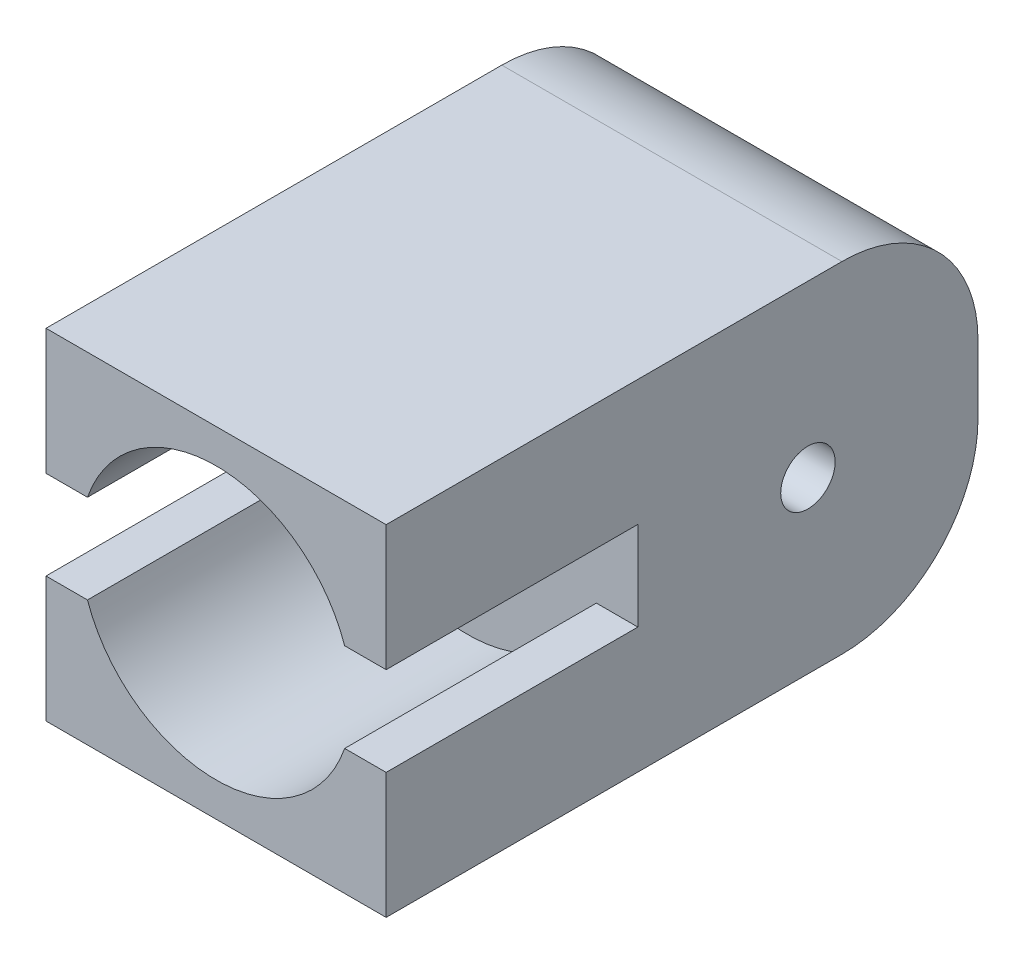
ISO-10303-21;
HEADER;
FILE_DESCRIPTION(('STEP AP214'),'2;1');
FILE_NAME('part.step','',(''),(''),'','','');
FILE_SCHEMA(('AUTOMOTIVE_DESIGN { 1 0 10303 214 1 1 1 1 }'));
ENDSEC;
DATA;
#1=APPLICATION_CONTEXT('core data for automotive mechanical design processes');
#2=APPLICATION_PROTOCOL_DEFINITION('international standard','automotive_design',2000,#1);
#3=PRODUCT_CONTEXT('',#1,'mechanical');
#4=PRODUCT('Part','Part','',(#3));
#5=PRODUCT_RELATED_PRODUCT_CATEGORY('part','',(#4));
#6=PRODUCT_DEFINITION_FORMATION('','',#4);
#7=PRODUCT_DEFINITION_CONTEXT('part definition',#1,'design');
#8=PRODUCT_DEFINITION('design','',#6,#7);
#9=PRODUCT_DEFINITION_SHAPE('','',#8);
#10=(LENGTH_UNIT() NAMED_UNIT(*) SI_UNIT(.MILLI.,.METRE.));
#11=(NAMED_UNIT(*) PLANE_ANGLE_UNIT() SI_UNIT($,.RADIAN.));
#12=(NAMED_UNIT(*) SI_UNIT($,.STERADIAN.) SOLID_ANGLE_UNIT());
#13=UNCERTAINTY_MEASURE_WITH_UNIT(LENGTH_MEASURE(1.E-05),#10,'distance_accuracy_value','');
#14=(GEOMETRIC_REPRESENTATION_CONTEXT(3) GLOBAL_UNCERTAINTY_ASSIGNED_CONTEXT((#13)) GLOBAL_UNIT_ASSIGNED_CONTEXT((#10,
#11,#12)) REPRESENTATION_CONTEXT('',''));
#15=CARTESIAN_POINT('',(0.,0.,0.));
#16=DIRECTION('',(0.,0.,1.));
#17=DIRECTION('',(1.,0.,0.));
#18=AXIS2_PLACEMENT_3D('',#15,#16,#17);
#19=CARTESIAN_POINT('',(0.,0.,37.));
#20=DIRECTION('',(0.,0.,-1.));
#21=DIRECTION('',(-1.,0.,0.));
#22=AXIS2_PLACEMENT_3D('',#19,#20,#21);
#23=CYLINDRICAL_SURFACE('',#22,20.);
#24=CARTESIAN_POINT('',(0.,0.,0.));
#25=DIRECTION('',(0.,0.,1.));
#26=DIRECTION('',(1.,0.,0.));
#27=AXIS2_PLACEMENT_3D('',#24,#25,#26);
#28=CIRCLE('',#27,20.);
#29=CARTESIAN_POINT('',(18.9022133151,6.53500817064945,0.));
#30=VERTEX_POINT('',#29);
#31=CARTESIAN_POINT('',(-18.9022133151,6.53500817064945,0.));
#32=VERTEX_POINT('',#31);
#33=EDGE_CURVE('E219',#30,#32,#28,.T.);
#34=ORIENTED_EDGE('',*,*,#33,.F.);
#35=DIRECTION('',(0.,0.,-1.));
#36=VECTOR('',#35,1.);
#37=CARTESIAN_POINT('',(18.9022133151,6.53500817064945,37.));
#38=LINE('',#37,#36);
#39=CARTESIAN_POINT('',(18.9022133151,6.53500817064945,37.));
#40=VERTEX_POINT('',#39);
#41=EDGE_CURVE('E267',#40,#30,#38,.T.);
#42=ORIENTED_EDGE('',*,*,#41,.F.);
#43=CARTESIAN_POINT('',(0.,0.,37.));
#44=DIRECTION('',(0.,0.,1.));
#45=DIRECTION('',(1.,0.,0.));
#46=AXIS2_PLACEMENT_3D('',#43,#44,#45);
#47=CIRCLE('',#46,20.);
#48=CARTESIAN_POINT('',(-18.9022133151,6.53500817064945,37.));
#49=VERTEX_POINT('',#48);
#50=EDGE_CURVE('E222',#40,#49,#47,.T.);
#51=ORIENTED_EDGE('',*,*,#50,.T.);
#52=DIRECTION('',(0.,0.,-1.));
#53=VECTOR('',#52,1.);
#54=CARTESIAN_POINT('',(-18.9022133151,6.53500817064945,37.));
#55=LINE('',#54,#53);
#56=EDGE_CURVE('E249',#49,#32,#55,.T.);
#57=ORIENTED_EDGE('',*,*,#56,.T.);
#58=EDGE_LOOP('',(#34,#42,#51,#57));
#59=FACE_BOUND('',#58,.T.);
#60=ADVANCED_FACE('F40',(#59),#23,.F.);
#61=CARTESIAN_POINT('',(0.,6.53500817064945,37.));
#62=DIRECTION('',(0.,1.,0.));
#63=DIRECTION('',(-1.,0.,0.));
#64=AXIS2_PLACEMENT_3D('',#61,#62,#63);
#65=PLANE('',#64);
#66=DIRECTION('',(1.,0.,0.));
#67=VECTOR('',#66,1.);
#68=CARTESIAN_POINT('',(0.,6.53500817064945,0.));
#69=LINE('',#68,#67);
#70=CARTESIAN_POINT('',(25.,6.53500817064946,0.));
#71=VERTEX_POINT('',#70);
#72=EDGE_CURVE('E245',#30,#71,#69,.T.);
#73=ORIENTED_EDGE('',*,*,#72,.T.);
#74=DIRECTION('',(0.,0.,-1.));
#75=VECTOR('',#74,1.);
#76=CARTESIAN_POINT('',(25.,6.53500817064946,37.));
#77=LINE('',#76,#75);
#78=CARTESIAN_POINT('',(25.,6.53500817064946,37.));
#79=VERTEX_POINT('',#78);
#80=EDGE_CURVE('E263',#79,#71,#77,.T.);
#81=ORIENTED_EDGE('',*,*,#80,.F.);
#82=DIRECTION('',(1.,0.,0.));
#83=VECTOR('',#82,1.);
#84=CARTESIAN_POINT('',(0.,6.53500817064945,37.));
#85=LINE('',#84,#83);
#86=EDGE_CURVE('E226',#40,#79,#85,.T.);
#87=ORIENTED_EDGE('',*,*,#86,.F.);
#88=ORIENTED_EDGE('',*,*,#41,.T.);
#89=EDGE_LOOP('',(#73,#81,#87,#88));
#90=FACE_BOUND('',#89,.T.);
#91=ADVANCED_FACE('F330',(#90),#65,.F.);
#92=CARTESIAN_POINT('',(25.,0.,37.));
#93=DIRECTION('',(1.,0.,0.));
#94=DIRECTION('',(0.,1.,0.));
#95=AXIS2_PLACEMENT_3D('',#92,#93,#94);
#96=PLANE('',#95);
#97=CARTESIAN_POINT('',(25.,0.,-25.));
#98=DIRECTION('',(1.,0.,0.));
#99=DIRECTION('',(0.,1.,0.));
#100=AXIS2_PLACEMENT_3D('',#97,#98,#99);
#101=CIRCLE('',#100,4.);
#102=CARTESIAN_POINT('',(25.,4.,-25.));
#103=VERTEX_POINT('',#102);
#104=EDGE_CURVE('E195',#103,#103,#101,.T.);
#105=ORIENTED_EDGE('',*,*,#104,.F.);
#106=EDGE_LOOP('',(#105));
#107=FACE_BOUND('',#106,.T.);
#108=DIRECTION('',(0.,0.,1.));
#109=VECTOR('',#108,1.);
#110=CARTESIAN_POINT('',(25.,-25.,-50.));
#111=LINE('',#110,#109);
#112=CARTESIAN_POINT('',(25.,-25.,-30.));
#113=VERTEX_POINT('',#112);
#114=CARTESIAN_POINT('',(25.,-25.,37.));
#115=VERTEX_POINT('',#114);
#116=EDGE_CURVE('E210',#113,#115,#111,.T.);
#117=ORIENTED_EDGE('',*,*,#116,.F.);
#118=CARTESIAN_POINT('',(25.,-5.00000000000001,-30.));
#119=DIRECTION('',(1.,0.,0.));
#120=DIRECTION('',(0.,1.,0.));
#121=AXIS2_PLACEMENT_3D('',#118,#119,#120);
#122=CIRCLE('',#121,20.);
#123=CARTESIAN_POINT('',(25.,-5.00000000000001,-50.));
#124=VERTEX_POINT('',#123);
#125=EDGE_CURVE('E278',#113,#124,#122,.T.);
#126=ORIENTED_EDGE('',*,*,#125,.T.);
#127=DIRECTION('',(0.,-1.,0.));
#128=VECTOR('',#127,1.);
#129=CARTESIAN_POINT('',(25.,0.,-50.));
#130=LINE('',#129,#128);
#131=CARTESIAN_POINT('',(25.,5.00000000000001,-50.));
#132=VERTEX_POINT('',#131);
#133=EDGE_CURVE('E202',#132,#124,#130,.T.);
#134=ORIENTED_EDGE('',*,*,#133,.F.);
#135=CARTESIAN_POINT('',(25.,5.00000000000001,-30.));
#136=DIRECTION('',(1.,0.,0.));
#137=DIRECTION('',(0.,1.,0.));
#138=AXIS2_PLACEMENT_3D('',#135,#136,#137);
#139=CIRCLE('',#138,20.);
#140=CARTESIAN_POINT('',(25.,25.,-30.));
#141=VERTEX_POINT('',#140);
#142=EDGE_CURVE('E275',#132,#141,#139,.T.);
#143=ORIENTED_EDGE('',*,*,#142,.T.);
#144=DIRECTION('',(0.,0.,-1.));
#145=VECTOR('',#144,1.);
#146=CARTESIAN_POINT('',(25.,25.,37.));
#147=LINE('',#146,#145);
#148=CARTESIAN_POINT('',(25.,25.,37.));
#149=VERTEX_POINT('',#148);
#150=EDGE_CURVE('E260',#149,#141,#147,.T.);
#151=ORIENTED_EDGE('',*,*,#150,.F.);
#152=DIRECTION('',(0.,-1.,0.));
#153=VECTOR('',#152,1.);
#154=CARTESIAN_POINT('',(25.,0.,37.));
#155=LINE('',#154,#153);
#156=EDGE_CURVE('E230',#149,#79,#155,.T.);
#157=ORIENTED_EDGE('',*,*,#156,.T.);
#158=ORIENTED_EDGE('',*,*,#80,.T.);
#159=DIRECTION('',(0.,-1.,0.));
#160=VECTOR('',#159,1.);
#161=CARTESIAN_POINT('',(25.,0.,0.));
#162=LINE('',#161,#160);
#163=CARTESIAN_POINT('',(25.,-6.53500817064945,0.));
#164=VERTEX_POINT('',#163);
#165=EDGE_CURVE('E154',#71,#164,#162,.T.);
#166=ORIENTED_EDGE('',*,*,#165,.T.);
#167=DIRECTION('',(0.,0.,-1.));
#168=VECTOR('',#167,1.);
#169=CARTESIAN_POINT('',(25.,-6.53500817064946,37.));
#170=LINE('',#169,#168);
#171=CARTESIAN_POINT('',(25.,-6.53500817064946,37.));
#172=VERTEX_POINT('',#171);
#173=EDGE_CURVE('E183',#172,#164,#170,.T.);
#174=ORIENTED_EDGE('',*,*,#173,.F.);
#175=DIRECTION('',(0.,1.,0.));
#176=VECTOR('',#175,1.);
#177=CARTESIAN_POINT('',(25.,0.,37.));
#178=LINE('',#177,#176);
#179=EDGE_CURVE('E178',#115,#172,#178,.T.);
#180=ORIENTED_EDGE('',*,*,#179,.F.);
#181=EDGE_LOOP('',(#117,#126,#134,#143,#151,#157,#158,#166,#174,#180));
#182=FACE_BOUND('',#181,.T.);
#183=ADVANCED_FACE('F303',(#107,#182),#96,.T.);
#184=CARTESIAN_POINT('',(0.,25.,37.));
#185=DIRECTION('',(0.,1.,0.));
#186=DIRECTION('',(-1.,0.,0.));
#187=AXIS2_PLACEMENT_3D('',#184,#185,#186);
#188=PLANE('',#187);
#189=ORIENTED_EDGE('',*,*,#150,.T.);
#190=DIRECTION('',(1.,0.,0.));
#191=VECTOR('',#190,1.);
#192=CARTESIAN_POINT('',(-25.,25.,-30.));
#193=LINE('',#192,#191);
#194=CARTESIAN_POINT('',(-25.,25.,-30.));
#195=VERTEX_POINT('',#194);
#196=EDGE_CURVE('E11',#141,#195,#193,.F.);
#197=ORIENTED_EDGE('',*,*,#196,.T.);
#198=DIRECTION('',(0.,0.,-1.));
#199=VECTOR('',#198,1.);
#200=CARTESIAN_POINT('',(-25.,25.,37.));
#201=LINE('',#200,#199);
#202=CARTESIAN_POINT('',(-25.,25.,37.));
#203=VERTEX_POINT('',#202);
#204=EDGE_CURVE('E257',#203,#195,#201,.T.);
#205=ORIENTED_EDGE('',*,*,#204,.F.);
#206=DIRECTION('',(1.,0.,0.));
#207=VECTOR('',#206,1.);
#208=CARTESIAN_POINT('',(0.,25.,37.));
#209=LINE('',#208,#207);
#210=EDGE_CURVE('E235',#203,#149,#209,.T.);
#211=ORIENTED_EDGE('',*,*,#210,.T.);
#212=EDGE_LOOP('',(#189,#197,#205,#211));
#213=FACE_BOUND('',#212,.T.);
#214=ADVANCED_FACE('F309',(#213),#188,.T.);
#215=CARTESIAN_POINT('',(-25.,0.,37.));
#216=DIRECTION('',(-1.,0.,0.));
#217=DIRECTION('',(0.,0.,1.));
#218=AXIS2_PLACEMENT_3D('',#215,#216,#217);
#219=PLANE('',#218);
#220=CARTESIAN_POINT('',(-25.,0.,-25.));
#221=DIRECTION('',(-1.,0.,0.));
#222=DIRECTION('',(0.,0.,1.));
#223=AXIS2_PLACEMENT_3D('',#220,#221,#222);
#224=CIRCLE('',#223,4.);
#225=CARTESIAN_POINT('',(-25.,0.,-21.));
#226=VERTEX_POINT('',#225);
#227=EDGE_CURVE('E337',#226,#226,#224,.T.);
#228=ORIENTED_EDGE('',*,*,#227,.F.);
#229=EDGE_LOOP('',(#228));
#230=FACE_BOUND('',#229,.T.);
#231=DIRECTION('',(0.,1.,0.));
#232=VECTOR('',#231,1.);
#233=CARTESIAN_POINT('',(-25.,0.,-50.));
#234=LINE('',#233,#232);
#235=CARTESIAN_POINT('',(-25.,-5.,-50.));
#236=VERTEX_POINT('',#235);
#237=CARTESIAN_POINT('',(-25.,5.,-50.));
#238=VERTEX_POINT('',#237);
#239=EDGE_CURVE('E206',#236,#238,#234,.T.);
#240=ORIENTED_EDGE('',*,*,#239,.F.);
#241=CARTESIAN_POINT('',(-25.,-5.,-30.));
#242=DIRECTION('',(-1.,0.,0.));
#243=DIRECTION('',(0.,0.,1.));
#244=AXIS2_PLACEMENT_3D('',#241,#242,#243);
#245=CIRCLE('',#244,20.);
#246=CARTESIAN_POINT('',(-25.,-25.,-30.));
#247=VERTEX_POINT('',#246);
#248=EDGE_CURVE('E49',#236,#247,#245,.T.);
#249=ORIENTED_EDGE('',*,*,#248,.T.);
#250=DIRECTION('',(0.,0.,1.));
#251=VECTOR('',#250,1.);
#252=CARTESIAN_POINT('',(-25.,-25.,-50.));
#253=LINE('',#252,#251);
#254=CARTESIAN_POINT('',(-25.,-25.,37.));
#255=VERTEX_POINT('',#254);
#256=EDGE_CURVE('E216',#247,#255,#253,.T.);
#257=ORIENTED_EDGE('',*,*,#256,.T.);
#258=DIRECTION('',(0.,-1.,0.));
#259=VECTOR('',#258,1.);
#260=CARTESIAN_POINT('',(-25.,0.,37.));
#261=LINE('',#260,#259);
#262=CARTESIAN_POINT('',(-25.,-6.53500817064945,37.));
#263=VERTEX_POINT('',#262);
#264=EDGE_CURVE('E171',#263,#255,#261,.T.);
#265=ORIENTED_EDGE('',*,*,#264,.F.);
#266=DIRECTION('',(0.,0.,-1.));
#267=VECTOR('',#266,1.);
#268=CARTESIAN_POINT('',(-25.,-6.53500817064945,37.));
#269=LINE('',#268,#267);
#270=CARTESIAN_POINT('',(-25.,-6.53500817064945,0.));
#271=VERTEX_POINT('',#270);
#272=EDGE_CURVE('E155',#263,#271,#269,.T.);
#273=ORIENTED_EDGE('',*,*,#272,.T.);
#274=DIRECTION('',(0.,1.,0.));
#275=VECTOR('',#274,1.);
#276=CARTESIAN_POINT('',(-25.,0.,0.));
#277=LINE('',#276,#275);
#278=CARTESIAN_POINT('',(-25.,6.53500817064945,0.));
#279=VERTEX_POINT('',#278);
#280=EDGE_CURVE('E207',#271,#279,#277,.T.);
#281=ORIENTED_EDGE('',*,*,#280,.T.);
#282=DIRECTION('',(0.,0.,-1.));
#283=VECTOR('',#282,1.);
#284=CARTESIAN_POINT('',(-25.,6.53500817064945,37.));
#285=LINE('',#284,#283);
#286=CARTESIAN_POINT('',(-25.,6.53500817064945,37.));
#287=VERTEX_POINT('',#286);
#288=EDGE_CURVE('E253',#287,#279,#285,.T.);
#289=ORIENTED_EDGE('',*,*,#288,.F.);
#290=DIRECTION('',(0.,1.,0.));
#291=VECTOR('',#290,1.);
#292=CARTESIAN_POINT('',(-25.,0.,37.));
#293=LINE('',#292,#291);
#294=EDGE_CURVE('E239',#287,#203,#293,.T.);
#295=ORIENTED_EDGE('',*,*,#294,.T.);
#296=ORIENTED_EDGE('',*,*,#204,.T.);
#297=CARTESIAN_POINT('',(-25.,5.,-30.));
#298=DIRECTION('',(-1.,0.,0.));
#299=DIRECTION('',(0.,0.,1.));
#300=AXIS2_PLACEMENT_3D('',#297,#298,#299);
#301=CIRCLE('',#300,20.);
#302=EDGE_CURVE('E61',#195,#238,#301,.T.);
#303=ORIENTED_EDGE('',*,*,#302,.T.);
#304=EDGE_LOOP('',(#240,#249,#257,#265,#273,#281,#289,#295,#296,#303));
#305=FACE_BOUND('',#304,.T.);
#306=ADVANCED_FACE('F292',(#230,#305),#219,.T.);
#307=EDGE_CURVE('E227',#279,#32,#69,.T.);
#308=ORIENTED_EDGE('',*,*,#307,.T.);
#309=ORIENTED_EDGE('',*,*,#56,.F.);
#310=EDGE_CURVE('E231',#287,#49,#85,.T.);
#311=ORIENTED_EDGE('',*,*,#310,.F.);
#312=ORIENTED_EDGE('',*,*,#288,.T.);
#313=EDGE_LOOP('',(#308,#309,#311,#312));
#314=FACE_BOUND('',#313,.T.);
#315=ADVANCED_FACE('F320',(#314),#65,.F.);
#316=CARTESIAN_POINT('',(0.,0.,37.));
#317=DIRECTION('',(0.,0.,1.));
#318=DIRECTION('',(1.,0.,0.));
#319=AXIS2_PLACEMENT_3D('',#316,#317,#318);
#320=PLANE('',#319);
#321=ORIENTED_EDGE('',*,*,#50,.F.);
#322=ORIENTED_EDGE('',*,*,#86,.T.);
#323=ORIENTED_EDGE('',*,*,#156,.F.);
#324=ORIENTED_EDGE('',*,*,#210,.F.);
#325=ORIENTED_EDGE('',*,*,#294,.F.);
#326=ORIENTED_EDGE('',*,*,#310,.T.);
#327=EDGE_LOOP('',(#321,#322,#323,#324,#325,#326));
#328=FACE_BOUND('',#327,.T.);
#329=ADVANCED_FACE('F314',(#328),#320,.T.);
#330=CARTESIAN_POINT('',(0.,0.,0.));
#331=DIRECTION('',(0.,0.,1.));
#332=DIRECTION('',(1.,0.,0.));
#333=AXIS2_PLACEMENT_3D('',#330,#331,#332);
#334=PLANE('',#333);
#335=DIRECTION('',(1.,0.,0.));
#336=VECTOR('',#335,1.);
#337=CARTESIAN_POINT('',(0.,-6.53500817064945,0.));
#338=LINE('',#337,#336);
#339=CARTESIAN_POINT('',(-18.9022133151,-6.53500817064945,0.));
#340=VERTEX_POINT('',#339);
#341=EDGE_CURVE('E194',#271,#340,#338,.T.);
#342=ORIENTED_EDGE('',*,*,#341,.T.);
#343=CARTESIAN_POINT('',(0.,0.,0.));
#344=DIRECTION('',(0.,0.,1.));
#345=DIRECTION('',(1.,0.,0.));
#346=AXIS2_PLACEMENT_3D('',#343,#344,#345);
#347=CIRCLE('',#346,20.);
#348=CARTESIAN_POINT('',(18.9022133151,-6.53500817064945,0.));
#349=VERTEX_POINT('',#348);
#350=EDGE_CURVE('E149',#340,#349,#347,.T.);
#351=ORIENTED_EDGE('',*,*,#350,.T.);
#352=EDGE_CURVE('E165',#349,#164,#338,.T.);
#353=ORIENTED_EDGE('',*,*,#352,.T.);
#354=ORIENTED_EDGE('',*,*,#165,.F.);
#355=ORIENTED_EDGE('',*,*,#72,.F.);
#356=ORIENTED_EDGE('',*,*,#33,.T.);
#357=ORIENTED_EDGE('',*,*,#307,.F.);
#358=ORIENTED_EDGE('',*,*,#280,.F.);
#359=EDGE_LOOP('',(#342,#351,#353,#354,#355,#356,#357,#358));
#360=FACE_BOUND('',#359,.T.);
#361=ADVANCED_FACE('F324',(#360),#334,.T.);
#362=CARTESIAN_POINT('',(0.,-25.,-50.));
#363=DIRECTION('',(0.,-1.,0.));
#364=DIRECTION('',(1.,0.,0.));
#365=AXIS2_PLACEMENT_3D('',#362,#363,#364);
#366=PLANE('',#365);
#367=ORIENTED_EDGE('',*,*,#256,.F.);
#368=DIRECTION('',(1.,0.,0.));
#369=VECTOR('',#368,1.);
#370=CARTESIAN_POINT('',(25.,-25.,-30.));
#371=LINE('',#370,#369);
#372=EDGE_CURVE('E271',#247,#113,#371,.T.);
#373=ORIENTED_EDGE('',*,*,#372,.T.);
#374=ORIENTED_EDGE('',*,*,#116,.T.);
#375=DIRECTION('',(1.,0.,0.));
#376=VECTOR('',#375,1.);
#377=CARTESIAN_POINT('',(0.,-25.,37.));
#378=LINE('',#377,#376);
#379=EDGE_CURVE('E174',#255,#115,#378,.T.);
#380=ORIENTED_EDGE('',*,*,#379,.F.);
#381=EDGE_LOOP('',(#367,#373,#374,#380));
#382=FACE_BOUND('',#381,.T.);
#383=ADVANCED_FACE('F298',(#382),#366,.T.);
#384=CARTESIAN_POINT('',(0.,0.,-50.));
#385=DIRECTION('',(0.,0.,1.));
#386=DIRECTION('',(1.,0.,0.));
#387=AXIS2_PLACEMENT_3D('',#384,#385,#386);
#388=PLANE('',#387);
#389=ORIENTED_EDGE('',*,*,#133,.T.);
#390=DIRECTION('',(1.,0.,0.));
#391=VECTOR('',#390,1.);
#392=CARTESIAN_POINT('',(-25.,-5.,-50.));
#393=LINE('',#392,#391);
#394=EDGE_CURVE('E285',#124,#236,#393,.F.);
#395=ORIENTED_EDGE('',*,*,#394,.T.);
#396=ORIENTED_EDGE('',*,*,#239,.T.);
#397=DIRECTION('',(1.,0.,0.));
#398=VECTOR('',#397,1.);
#399=CARTESIAN_POINT('',(25.,5.00000000000001,-50.));
#400=LINE('',#399,#398);
#401=EDGE_CURVE('E281',#238,#132,#400,.T.);
#402=ORIENTED_EDGE('',*,*,#401,.T.);
#403=EDGE_LOOP('',(#389,#395,#396,#402));
#404=FACE_BOUND('',#403,.T.);
#405=ADVANCED_FACE('F305',(#404),#388,.F.);
#406=CARTESIAN_POINT('',(0.,0.,37.));
#407=DIRECTION('',(0.,0.,-1.));
#408=DIRECTION('',(-1.,0.,0.));
#409=AXIS2_PLACEMENT_3D('',#406,#407,#408);
#410=CYLINDRICAL_SURFACE('',#409,20.);
#411=ORIENTED_EDGE('',*,*,#350,.F.);
#412=DIRECTION('',(0.,0.,-1.));
#413=VECTOR('',#412,1.);
#414=CARTESIAN_POINT('',(-18.9022133151,-6.53500817064945,37.));
#415=LINE('',#414,#413);
#416=CARTESIAN_POINT('',(-18.9022133151,-6.53500817064945,37.));
#417=VERTEX_POINT('',#416);
#418=EDGE_CURVE('E143',#417,#340,#415,.T.);
#419=ORIENTED_EDGE('',*,*,#418,.F.);
#420=CARTESIAN_POINT('',(0.,0.,37.));
#421=DIRECTION('',(0.,0.,1.));
#422=DIRECTION('',(1.,0.,0.));
#423=AXIS2_PLACEMENT_3D('',#420,#421,#422);
#424=CIRCLE('',#423,20.);
#425=CARTESIAN_POINT('',(18.9022133151,-6.53500817064945,37.));
#426=VERTEX_POINT('',#425);
#427=EDGE_CURVE('E147',#417,#426,#424,.T.);
#428=ORIENTED_EDGE('',*,*,#427,.T.);
#429=DIRECTION('',(0.,0.,-1.));
#430=VECTOR('',#429,1.);
#431=CARTESIAN_POINT('',(18.9022133151,-6.53500817064945,37.));
#432=LINE('',#431,#430);
#433=EDGE_CURVE('E177',#426,#349,#432,.T.);
#434=ORIENTED_EDGE('',*,*,#433,.T.);
#435=EDGE_LOOP('',(#411,#419,#428,#434));
#436=FACE_BOUND('',#435,.T.);
#437=ADVANCED_FACE('F145',(#436),#410,.F.);
#438=CARTESIAN_POINT('',(0.,-6.53500817064945,37.));
#439=DIRECTION('',(0.,1.,0.));
#440=DIRECTION('',(-1.,0.,0.));
#441=AXIS2_PLACEMENT_3D('',#438,#439,#440);
#442=PLANE('',#441);
#443=ORIENTED_EDGE('',*,*,#341,.F.);
#444=ORIENTED_EDGE('',*,*,#272,.F.);
#445=DIRECTION('',(1.,0.,0.));
#446=VECTOR('',#445,1.);
#447=CARTESIAN_POINT('',(0.,-6.53500817064945,37.));
#448=LINE('',#447,#446);
#449=EDGE_CURVE('E161',#263,#417,#448,.T.);
#450=ORIENTED_EDGE('',*,*,#449,.T.);
#451=ORIENTED_EDGE('',*,*,#418,.T.);
#452=EDGE_LOOP('',(#443,#444,#450,#451));
#453=FACE_BOUND('',#452,.T.);
#454=ADVANCED_FACE('F167',(#453),#442,.T.);
#455=ORIENTED_EDGE('',*,*,#352,.F.);
#456=ORIENTED_EDGE('',*,*,#433,.F.);
#457=EDGE_CURVE('E163',#426,#172,#448,.T.);
#458=ORIENTED_EDGE('',*,*,#457,.T.);
#459=ORIENTED_EDGE('',*,*,#173,.T.);
#460=EDGE_LOOP('',(#455,#456,#458,#459));
#461=FACE_BOUND('',#460,.T.);
#462=ADVANCED_FACE('F332',(#461),#442,.T.);
#463=CARTESIAN_POINT('',(0.,0.,37.));
#464=DIRECTION('',(0.,0.,1.));
#465=DIRECTION('',(1.,0.,0.));
#466=AXIS2_PLACEMENT_3D('',#463,#464,#465);
#467=PLANE('',#466);
#468=ORIENTED_EDGE('',*,*,#427,.F.);
#469=ORIENTED_EDGE('',*,*,#449,.F.);
#470=ORIENTED_EDGE('',*,*,#264,.T.);
#471=ORIENTED_EDGE('',*,*,#379,.T.);
#472=ORIENTED_EDGE('',*,*,#179,.T.);
#473=ORIENTED_EDGE('',*,*,#457,.F.);
#474=EDGE_LOOP('',(#468,#469,#470,#471,#472,#473));
#475=FACE_BOUND('',#474,.T.);
#476=ADVANCED_FACE('F159',(#475),#467,.T.);
#477=CARTESIAN_POINT('',(29.,0.,-25.));
#478=DIRECTION('',(-1.,0.,0.));
#479=DIRECTION('',(0.,0.,1.));
#480=AXIS2_PLACEMENT_3D('',#477,#478,#479);
#481=CYLINDRICAL_SURFACE('',#480,4.);
#482=ORIENTED_EDGE('',*,*,#104,.T.);
#483=EDGE_LOOP('',(#482));
#484=FACE_BOUND('',#483,.T.);
#485=ORIENTED_EDGE('',*,*,#227,.T.);
#486=EDGE_LOOP('',(#485));
#487=FACE_BOUND('',#486,.T.);
#488=ADVANCED_FACE('F343',(#484,#487),#481,.F.);
#489=CARTESIAN_POINT('',(0.,-5.,-30.));
#490=DIRECTION('',(-1.,0.,0.));
#491=DIRECTION('',(0.,-1.,0.));
#492=AXIS2_PLACEMENT_3D('',#489,#490,#491);
#493=CYLINDRICAL_SURFACE('',#492,20.);
#494=ORIENTED_EDGE('',*,*,#248,.F.);
#495=ORIENTED_EDGE('',*,*,#394,.F.);
#496=ORIENTED_EDGE('',*,*,#125,.F.);
#497=ORIENTED_EDGE('',*,*,#372,.F.);
#498=EDGE_LOOP('',(#494,#495,#496,#497));
#499=FACE_BOUND('',#498,.T.);
#500=ADVANCED_FACE('F300',(#499),#493,.T.);
#501=CARTESIAN_POINT('',(0.,5.,-30.));
#502=DIRECTION('',(-1.,0.,0.));
#503=DIRECTION('',(0.,-1.,0.));
#504=AXIS2_PLACEMENT_3D('',#501,#502,#503);
#505=CYLINDRICAL_SURFACE('',#504,20.);
#506=ORIENTED_EDGE('',*,*,#302,.F.);
#507=ORIENTED_EDGE('',*,*,#196,.F.);
#508=ORIENTED_EDGE('',*,*,#142,.F.);
#509=ORIENTED_EDGE('',*,*,#401,.F.);
#510=EDGE_LOOP('',(#506,#507,#508,#509));
#511=FACE_BOUND('',#510,.T.);
#512=ADVANCED_FACE('F42',(#511),#505,.T.);
#513=CLOSED_SHELL('',(#60,#91,#183,#214,#306,#315,#329,#361,#383,#405,#437,#454,#462,#476,#488,
#500,#512));
#514=MANIFOLD_SOLID_BREP('B2',#513);
#515=ADVANCED_BREP_SHAPE_REPRESENTATION('',(#18,#514),#14);
#516=SHAPE_DEFINITION_REPRESENTATION(#9,#515);
ENDSEC;
END-ISO-10303-21;
